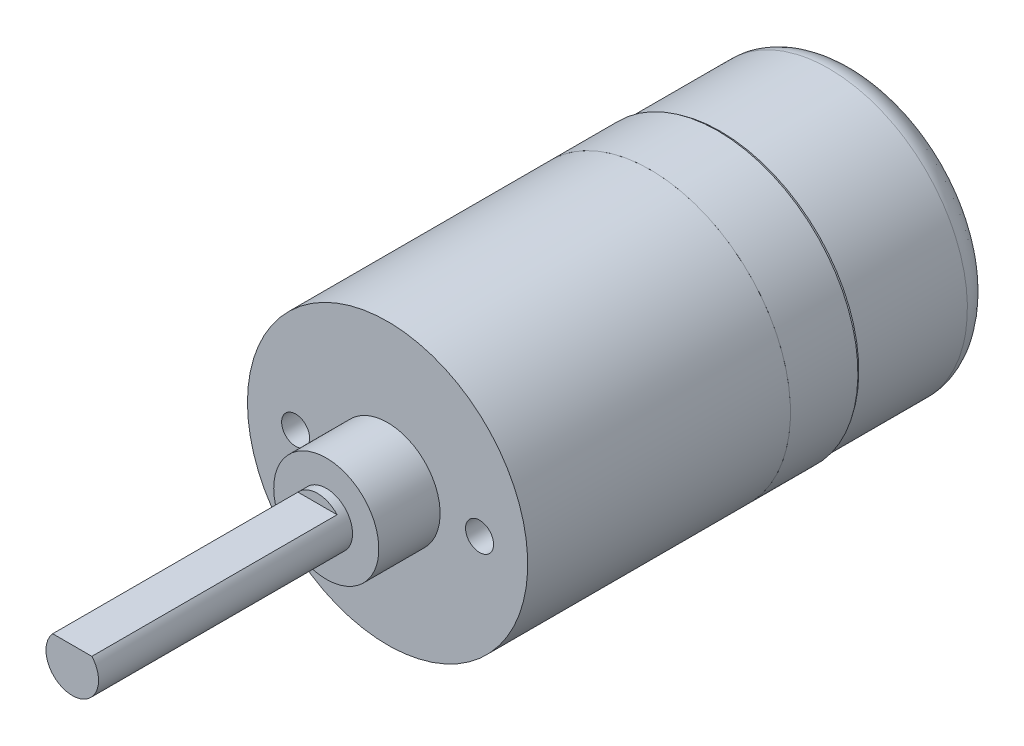
ISO-10303-21;
HEADER;
FILE_DESCRIPTION(('STEP AP214'),'2;1');
FILE_NAME('part.step','',(''),(''),'','','');
FILE_SCHEMA(('AUTOMOTIVE_DESIGN { 1 0 10303 214 1 1 1 1 }'));
ENDSEC;
DATA;
#1=APPLICATION_CONTEXT('core data for automotive mechanical design processes');
#2=APPLICATION_PROTOCOL_DEFINITION('international standard','automotive_design',2000,#1);
#3=PRODUCT_CONTEXT('',#1,'mechanical');
#4=PRODUCT('Part','Part','',(#3));
#5=PRODUCT_RELATED_PRODUCT_CATEGORY('part','',(#4));
#6=PRODUCT_DEFINITION_FORMATION('','',#4);
#7=PRODUCT_DEFINITION_CONTEXT('part definition',#1,'design');
#8=PRODUCT_DEFINITION('design','',#6,#7);
#9=PRODUCT_DEFINITION_SHAPE('','',#8);
#10=(LENGTH_UNIT() NAMED_UNIT(*) SI_UNIT(.MILLI.,.METRE.));
#11=(NAMED_UNIT(*) PLANE_ANGLE_UNIT() SI_UNIT($,.RADIAN.));
#12=(NAMED_UNIT(*) SI_UNIT($,.STERADIAN.) SOLID_ANGLE_UNIT());
#13=UNCERTAINTY_MEASURE_WITH_UNIT(LENGTH_MEASURE(1.E-05),#10,'distance_accuracy_value','');
#14=(GEOMETRIC_REPRESENTATION_CONTEXT(3) GLOBAL_UNCERTAINTY_ASSIGNED_CONTEXT((#13)) GLOBAL_UNIT_ASSIGNED_CONTEXT((#10,
#11,#12)) REPRESENTATION_CONTEXT('',''));
#15=CARTESIAN_POINT('',(0.,0.,0.));
#16=DIRECTION('',(0.,0.,1.));
#17=DIRECTION('',(1.,0.,0.));
#18=AXIS2_PLACEMENT_3D('',#15,#16,#17);
#19=CARTESIAN_POINT('',(0.,0.,33.));
#20=DIRECTION('',(0.,0.,1.));
#21=DIRECTION('',(1.,0.,0.));
#22=AXIS2_PLACEMENT_3D('',#19,#20,#21);
#23=PLANE('',#22);
#24=CARTESIAN_POINT('',(0.,0.,33.));
#25=DIRECTION('',(0.,0.,1.));
#26=DIRECTION('',(1.,0.,0.));
#27=AXIS2_PLACEMENT_3D('',#24,#25,#26);
#28=CIRCLE('',#27,1.5);
#29=CARTESIAN_POINT('',(1.11803398874988,1.00000000000001,33.));
#30=VERTEX_POINT('',#29);
#31=CARTESIAN_POINT('',(-1.11803398874988,1.00000000000001,33.));
#32=VERTEX_POINT('',#31);
#33=EDGE_CURVE('P0_E69',#30,#32,#28,.F.);
#34=ORIENTED_EDGE('',*,*,#33,.F.);
#35=DIRECTION('',(-1.,0.,0.));
#36=VECTOR('',#35,1.);
#37=CARTESIAN_POINT('',(-1.11803398874988,1.00000000000001,33.));
#38=LINE('',#37,#36);
#39=EDGE_CURVE('P0_E76',#30,#32,#38,.T.);
#40=ORIENTED_EDGE('',*,*,#39,.T.);
#41=EDGE_LOOP('',(#34,#40));
#42=FACE_BOUND('',#41,.T.);
#43=ADVANCED_FACE('P0_F38',(#42),#23,.T.);
#44=CARTESIAN_POINT('',(-5.25,0.,12.4999999999318));
#45=DIRECTION('',(0.,0.,1.));
#46=DIRECTION('',(0.,-1.,0.));
#47=AXIS2_PLACEMENT_3D('',#44,#45,#46);
#48=CONICAL_SURFACE('',#47,0.79999999992333,1.02974425862737);
#49=CARTESIAN_POINT('',(-5.25000000004638,0.,12.01931150473));
#50=VERTEX_POINT('',#49);
#51=VERTEX_LOOP('',#50);
#52=FACE_BOUND('',#51,.T.);
#53=CARTESIAN_POINT('',(-5.25,0.,12.5));
#54=DIRECTION('',(0.,0.,1.));
#55=DIRECTION('',(1.,0.,0.));
#56=AXIS2_PLACEMENT_3D('',#53,#54,#55);
#57=CIRCLE('',#56,0.799999999999999);
#58=CARTESIAN_POINT('',(-4.45,0.,12.5));
#59=VERTEX_POINT('',#58);
#60=EDGE_CURVE('P0_E95',#59,#59,#57,.T.);
#61=ORIENTED_EDGE('',*,*,#60,.T.);
#62=EDGE_LOOP('',(#61));
#63=FACE_BOUND('',#62,.T.);
#64=ADVANCED_FACE('P0_F150',(#52,#63),#48,.F.);
#65=CARTESIAN_POINT('',(5.25,0.,12.4999999999886));
#66=DIRECTION('',(0.,0.,1.));
#67=DIRECTION('',(1.,0.,0.));
#68=AXIS2_PLACEMENT_3D('',#65,#66,#67);
#69=CONICAL_SURFACE('',#68,0.800000000072941,1.02974425870993);
#70=CARTESIAN_POINT('',(5.25000000004638,0.,12.0193115047869));
#71=VERTEX_POINT('',#70);
#72=VERTEX_LOOP('',#71);
#73=FACE_BOUND('',#72,.T.);
#74=CARTESIAN_POINT('',(5.25,0.,12.5));
#75=DIRECTION('',(0.,0.,1.));
#76=DIRECTION('',(1.,0.,0.));
#77=AXIS2_PLACEMENT_3D('',#74,#75,#76);
#78=CIRCLE('',#77,0.799999999999999);
#79=CARTESIAN_POINT('',(6.05,0.,12.5));
#80=VERTEX_POINT('',#79);
#81=EDGE_CURVE('P0_E101',#80,#80,#78,.T.);
#82=ORIENTED_EDGE('',*,*,#81,.T.);
#83=EDGE_LOOP('',(#82));
#84=FACE_BOUND('',#83,.T.);
#85=ADVANCED_FACE('P0_F130',(#73,#84),#69,.F.);
#86=CARTESIAN_POINT('',(0.,8.,0.));
#87=DIRECTION('',(0.,0.,-1.));
#88=DIRECTION('',(-1.,0.,0.));
#89=AXIS2_PLACEMENT_3D('',#86,#87,#88);
#90=PLANE('',#89);
#91=CARTESIAN_POINT('',(0.,0.,0.));
#92=DIRECTION('',(0.,0.,-1.));
#93=DIRECTION('',(-1.,0.,0.));
#94=AXIS2_PLACEMENT_3D('',#91,#92,#93);
#95=CIRCLE('',#94,8.);
#96=CARTESIAN_POINT('',(-8.,0.,0.));
#97=VERTEX_POINT('',#96);
#98=EDGE_CURVE('P0_E75',#97,#97,#95,.F.);
#99=ORIENTED_EDGE('',*,*,#98,.F.);
#100=EDGE_LOOP('',(#99));
#101=FACE_BOUND('',#100,.T.);
#102=ADVANCED_FACE('P0_F145',(#101),#90,.T.);
#103=CARTESIAN_POINT('',(-5.25,0.,15.));
#104=DIRECTION('',(0.,0.,1.));
#105=DIRECTION('',(1.,0.,0.));
#106=AXIS2_PLACEMENT_3D('',#103,#104,#105);
#107=CYLINDRICAL_SURFACE('',#106,0.799999999999999);
#108=CARTESIAN_POINT('',(-5.25,0.,15.));
#109=DIRECTION('',(0.,0.,1.));
#110=DIRECTION('',(1.,0.,0.));
#111=AXIS2_PLACEMENT_3D('',#108,#109,#110);
#112=CIRCLE('',#111,0.799999999999999);
#113=CARTESIAN_POINT('',(-4.45,0.,15.));
#114=VERTEX_POINT('',#113);
#115=EDGE_CURVE('P0_E98',#114,#114,#112,.F.);
#116=ORIENTED_EDGE('',*,*,#115,.F.);
#117=EDGE_LOOP('',(#116));
#118=FACE_BOUND('',#117,.T.);
#119=ORIENTED_EDGE('',*,*,#60,.F.);
#120=EDGE_LOOP('',(#119));
#121=FACE_BOUND('',#120,.T.);
#122=ADVANCED_FACE('P0_F135',(#118,#121),#107,.F.);
#123=CARTESIAN_POINT('',(5.25,0.,15.));
#124=DIRECTION('',(0.,0.,1.));
#125=DIRECTION('',(1.,0.,0.));
#126=AXIS2_PLACEMENT_3D('',#123,#124,#125);
#127=CYLINDRICAL_SURFACE('',#126,0.799999999999999);
#128=CARTESIAN_POINT('',(5.25,0.,15.));
#129=DIRECTION('',(0.,0.,1.));
#130=DIRECTION('',(1.,0.,0.));
#131=AXIS2_PLACEMENT_3D('',#128,#129,#130);
#132=CIRCLE('',#131,0.799999999999999);
#133=CARTESIAN_POINT('',(6.05,0.,15.));
#134=VERTEX_POINT('',#133);
#135=EDGE_CURVE('P0_E102',#134,#134,#132,.F.);
#136=ORIENTED_EDGE('',*,*,#135,.F.);
#137=EDGE_LOOP('',(#136));
#138=FACE_BOUND('',#137,.T.);
#139=ORIENTED_EDGE('',*,*,#81,.F.);
#140=EDGE_LOOP('',(#139));
#141=FACE_BOUND('',#140,.T.);
#142=ADVANCED_FACE('P0_F132',(#138,#141),#127,.F.);
#143=CARTESIAN_POINT('',(0.,0.,0.));
#144=DIRECTION('',(0.,0.,-1.));
#145=DIRECTION('',(-1.,0.,0.));
#146=AXIS2_PLACEMENT_3D('',#143,#144,#145);
#147=CYLINDRICAL_SURFACE('',#146,8.);
#148=ORIENTED_EDGE('',*,*,#98,.T.);
#149=EDGE_LOOP('',(#148));
#150=FACE_BOUND('',#149,.T.);
#151=CARTESIAN_POINT('',(0.,0.,15.));
#152=DIRECTION('',(0.,0.,-1.));
#153=DIRECTION('',(-1.,0.,0.));
#154=AXIS2_PLACEMENT_3D('',#151,#152,#153);
#155=CIRCLE('',#154,8.);
#156=CARTESIAN_POINT('',(-8.,0.,15.));
#157=VERTEX_POINT('',#156);
#158=EDGE_CURVE('P0_E112',#157,#157,#155,.T.);
#159=ORIENTED_EDGE('',*,*,#158,.T.);
#160=EDGE_LOOP('',(#159));
#161=FACE_BOUND('',#160,.T.);
#162=ADVANCED_FACE('P0_F134',(#150,#161),#147,.T.);
#163=CARTESIAN_POINT('',(0.,3.,15.));
#164=DIRECTION('',(0.,0.,1.));
#165=DIRECTION('',(1.,0.,0.));
#166=AXIS2_PLACEMENT_3D('',#163,#164,#165);
#167=PLANE('',#166);
#168=ORIENTED_EDGE('',*,*,#158,.F.);
#169=EDGE_LOOP('',(#168));
#170=FACE_BOUND('',#169,.T.);
#171=CARTESIAN_POINT('',(0.,0.,15.));
#172=DIRECTION('',(0.,0.,-1.));
#173=DIRECTION('',(-1.,0.,0.));
#174=AXIS2_PLACEMENT_3D('',#171,#172,#173);
#175=CIRCLE('',#174,3.);
#176=CARTESIAN_POINT('',(-3.,0.,15.));
#177=VERTEX_POINT('',#176);
#178=EDGE_CURVE('P0_E107',#177,#177,#175,.T.);
#179=ORIENTED_EDGE('',*,*,#178,.T.);
#180=EDGE_LOOP('',(#179));
#181=FACE_BOUND('',#180,.T.);
#182=ORIENTED_EDGE('',*,*,#135,.T.);
#183=EDGE_LOOP('',(#182));
#184=FACE_BOUND('',#183,.T.);
#185=ORIENTED_EDGE('',*,*,#115,.T.);
#186=EDGE_LOOP('',(#185));
#187=FACE_BOUND('',#186,.T.);
#188=ADVANCED_FACE('P0_F142',(#170,#181,#184,#187),#167,.T.);
#189=CARTESIAN_POINT('',(0.,0.,0.));
#190=DIRECTION('',(0.,0.,-1.));
#191=DIRECTION('',(-1.,0.,0.));
#192=AXIS2_PLACEMENT_3D('',#189,#190,#191);
#193=CYLINDRICAL_SURFACE('',#192,3.);
#194=ORIENTED_EDGE('',*,*,#178,.F.);
#195=EDGE_LOOP('',(#194));
#196=FACE_BOUND('',#195,.T.);
#197=CARTESIAN_POINT('',(0.,0.,18.5));
#198=DIRECTION('',(0.,0.,-1.));
#199=DIRECTION('',(-1.,0.,0.));
#200=AXIS2_PLACEMENT_3D('',#197,#198,#199);
#201=CIRCLE('',#200,3.);
#202=CARTESIAN_POINT('',(-3.,0.,18.5));
#203=VERTEX_POINT('',#202);
#204=EDGE_CURVE('P0_E90',#203,#203,#201,.T.);
#205=ORIENTED_EDGE('',*,*,#204,.T.);
#206=EDGE_LOOP('',(#205));
#207=FACE_BOUND('',#206,.T.);
#208=ADVANCED_FACE('P0_F167',(#196,#207),#193,.T.);
#209=CARTESIAN_POINT('',(0.,0.,19.));
#210=DIRECTION('',(0.,0.,1.));
#211=DIRECTION('',(1.,0.,0.));
#212=AXIS2_PLACEMENT_3D('',#209,#210,#211);
#213=PLANE('',#212);
#214=CARTESIAN_POINT('',(0.,0.,19.));
#215=DIRECTION('',(0.,0.,-1.));
#216=DIRECTION('',(-1.,0.,0.));
#217=AXIS2_PLACEMENT_3D('',#214,#215,#216);
#218=CIRCLE('',#217,1.5);
#219=CARTESIAN_POINT('',(-1.11803398874988,1.00000000000001,19.));
#220=VERTEX_POINT('',#219);
#221=CARTESIAN_POINT('',(1.11803398874988,1.00000000000001,19.));
#222=VERTEX_POINT('',#221);
#223=EDGE_CURVE('P0_E82',#220,#222,#218,.T.);
#224=ORIENTED_EDGE('',*,*,#223,.F.);
#225=DIRECTION('',(1.,0.,0.));
#226=VECTOR('',#225,1.);
#227=CARTESIAN_POINT('',(-1.11803398874988,1.00000000000001,19.));
#228=LINE('',#227,#226);
#229=EDGE_CURVE('P0_E11',#220,#222,#228,.T.);
#230=ORIENTED_EDGE('',*,*,#229,.T.);
#231=EDGE_LOOP('',(#224,#230));
#232=FACE_BOUND('',#231,.T.);
#233=ADVANCED_FACE('P0_F165',(#232),#213,.T.);
#234=CARTESIAN_POINT('',(-1.11803398874988,1.00000000000001,19.));
#235=DIRECTION('',(0.,-1.,0.));
#236=DIRECTION('',(0.,0.,-1.));
#237=AXIS2_PLACEMENT_3D('',#234,#235,#236);
#238=PLANE('',#237);
#239=ORIENTED_EDGE('',*,*,#39,.F.);
#240=DIRECTION('',(0.,0.,-1.));
#241=VECTOR('',#240,1.);
#242=CARTESIAN_POINT('',(1.11803398874988,1.00000000000001,0.));
#243=LINE('',#242,#241);
#244=EDGE_CURVE('P0_E74',#222,#30,#243,.F.);
#245=ORIENTED_EDGE('',*,*,#244,.F.);
#246=ORIENTED_EDGE('',*,*,#229,.F.);
#247=DIRECTION('',(0.,0.,-1.));
#248=VECTOR('',#247,1.);
#249=CARTESIAN_POINT('',(-1.11803398874988,1.00000000000001,0.));
#250=LINE('',#249,#248);
#251=EDGE_CURVE('P0_E42',#32,#220,#250,.T.);
#252=ORIENTED_EDGE('',*,*,#251,.F.);
#253=EDGE_LOOP('',(#239,#245,#246,#252));
#254=FACE_BOUND('',#253,.T.);
#255=ADVANCED_FACE('P0_F80',(#254),#238,.F.);
#256=CARTESIAN_POINT('',(0.,1.5,18.5));
#257=DIRECTION('',(0.,0.,1.));
#258=DIRECTION('',(1.,0.,0.));
#259=AXIS2_PLACEMENT_3D('',#256,#257,#258);
#260=PLANE('',#259);
#261=ORIENTED_EDGE('',*,*,#204,.F.);
#262=EDGE_LOOP('',(#261));
#263=FACE_BOUND('',#262,.T.);
#264=CARTESIAN_POINT('',(0.,0.,18.5));
#265=DIRECTION('',(0.,0.,-1.));
#266=DIRECTION('',(-1.,0.,0.));
#267=AXIS2_PLACEMENT_3D('',#264,#265,#266);
#268=CIRCLE('',#267,1.5);
#269=CARTESIAN_POINT('',(-1.5,0.,18.5));
#270=VERTEX_POINT('',#269);
#271=EDGE_CURVE('P0_E84',#270,#270,#268,.T.);
#272=ORIENTED_EDGE('',*,*,#271,.T.);
#273=EDGE_LOOP('',(#272));
#274=FACE_BOUND('',#273,.T.);
#275=ADVANCED_FACE('P0_F161',(#263,#274),#260,.T.);
#276=CARTESIAN_POINT('',(0.,0.,0.));
#277=DIRECTION('',(0.,0.,-1.));
#278=DIRECTION('',(-1.,0.,0.));
#279=AXIS2_PLACEMENT_3D('',#276,#277,#278);
#280=CYLINDRICAL_SURFACE('',#279,1.5);
#281=ORIENTED_EDGE('',*,*,#271,.F.);
#282=EDGE_LOOP('',(#281));
#283=FACE_BOUND('',#282,.T.);
#284=ORIENTED_EDGE('',*,*,#244,.T.);
#285=ORIENTED_EDGE('',*,*,#33,.T.);
#286=ORIENTED_EDGE('',*,*,#251,.T.);
#287=ORIENTED_EDGE('',*,*,#223,.T.);
#288=EDGE_LOOP('',(#284,#285,#286,#287));
#289=FACE_BOUND('',#288,.T.);
#290=ADVANCED_FACE('P0_F40',(#283,#289),#280,.T.);
#291=CLOSED_SHELL('',(#43,#64,#85,#102,#122,#142,#162,#188,#208,#233,#255,#275,#290));
#292=MANIFOLD_SOLID_BREP('P0_B2',#291);
#293=CARTESIAN_POINT('',(0.,0.,0.));
#294=DIRECTION('',(0.,0.,1.));
#295=DIRECTION('',(0.,-1.,0.));
#296=AXIS2_PLACEMENT_3D('',#293,#294,#295);
#297=PLANE('',#296);
#298=CARTESIAN_POINT('',(0.,0.,0.));
#299=DIRECTION('',(0.,0.,-1.));
#300=DIRECTION('',(0.,1.,0.));
#301=AXIS2_PLACEMENT_3D('',#298,#299,#300);
#302=CIRCLE('',#301,8.);
#303=CARTESIAN_POINT('',(0.,8.,0.));
#304=VERTEX_POINT('',#303);
#305=EDGE_CURVE('P1_E35',#304,#304,#302,.T.);
#306=ORIENTED_EDGE('',*,*,#305,.F.);
#307=EDGE_LOOP('',(#306));
#308=FACE_BOUND('',#307,.T.);
#309=ADVANCED_FACE('P1_F14',(#308),#297,.T.);
#310=CARTESIAN_POINT('',(0.,0.,0.));
#311=DIRECTION('',(0.,0.,-1.));
#312=DIRECTION('',(0.,1.,0.));
#313=AXIS2_PLACEMENT_3D('',#310,#311,#312);
#314=CYLINDRICAL_SURFACE('',#313,8.);
#315=CARTESIAN_POINT('',(0.,0.,-3.85));
#316=DIRECTION('',(0.,0.,-1.));
#317=DIRECTION('',(0.,1.,0.));
#318=AXIS2_PLACEMENT_3D('',#315,#316,#317);
#319=CIRCLE('',#318,8.);
#320=CARTESIAN_POINT('',(0.,8.,-3.85));
#321=VERTEX_POINT('',#320);
#322=EDGE_CURVE('P1_E26',#321,#321,#319,.T.);
#323=ORIENTED_EDGE('',*,*,#322,.F.);
#324=EDGE_LOOP('',(#323));
#325=FACE_BOUND('',#324,.T.);
#326=ORIENTED_EDGE('',*,*,#305,.T.);
#327=EDGE_LOOP('',(#326));
#328=FACE_BOUND('',#327,.T.);
#329=ADVANCED_FACE('P1_F40',(#325,#328),#314,.T.);
#330=CARTESIAN_POINT('',(0.,8.,-3.85));
#331=DIRECTION('',(0.,0.,-1.));
#332=DIRECTION('',(0.,1.,0.));
#333=AXIS2_PLACEMENT_3D('',#330,#331,#332);
#334=PLANE('',#333);
#335=CARTESIAN_POINT('',(0.,0.,-3.85));
#336=DIRECTION('',(0.,0.,-1.));
#337=DIRECTION('',(0.,1.,0.));
#338=AXIS2_PLACEMENT_3D('',#335,#336,#337);
#339=CIRCLE('',#338,6.);
#340=CARTESIAN_POINT('',(0.,6.,-3.85));
#341=VERTEX_POINT('',#340);
#342=EDGE_CURVE('P1_E21',#341,#341,#339,.T.);
#343=ORIENTED_EDGE('',*,*,#342,.F.);
#344=EDGE_LOOP('',(#343));
#345=FACE_BOUND('',#344,.T.);
#346=ORIENTED_EDGE('',*,*,#322,.T.);
#347=EDGE_LOOP('',(#346));
#348=FACE_BOUND('',#347,.T.);
#349=ADVANCED_FACE('P1_F47',(#345,#348),#334,.T.);
#350=CARTESIAN_POINT('',(0.,6.,-9.85));
#351=DIRECTION('',(0.,0.,-1.));
#352=DIRECTION('',(0.,1.,0.));
#353=AXIS2_PLACEMENT_3D('',#350,#351,#352);
#354=PLANE('',#353);
#355=CARTESIAN_POINT('',(0.,0.,-9.85));
#356=DIRECTION('',(0.,0.,-1.));
#357=DIRECTION('',(0.,1.,0.));
#358=AXIS2_PLACEMENT_3D('',#355,#356,#357);
#359=CIRCLE('',#358,6.);
#360=CARTESIAN_POINT('',(0.,6.,-9.85));
#361=VERTEX_POINT('',#360);
#362=EDGE_CURVE('P1_E10',#361,#361,#359,.F.);
#363=ORIENTED_EDGE('',*,*,#362,.F.);
#364=EDGE_LOOP('',(#363));
#365=FACE_BOUND('',#364,.T.);
#366=ADVANCED_FACE('P1_F51',(#365),#354,.T.);
#367=CARTESIAN_POINT('',(0.,0.,0.));
#368=DIRECTION('',(0.,0.,-1.));
#369=DIRECTION('',(0.,1.,0.));
#370=AXIS2_PLACEMENT_3D('',#367,#368,#369);
#371=CYLINDRICAL_SURFACE('',#370,6.);
#372=ORIENTED_EDGE('',*,*,#362,.T.);
#373=EDGE_LOOP('',(#372));
#374=FACE_BOUND('',#373,.T.);
#375=ORIENTED_EDGE('',*,*,#342,.T.);
#376=EDGE_LOOP('',(#375));
#377=FACE_BOUND('',#376,.T.);
#378=ADVANCED_FACE('P1_F49',(#374,#377),#371,.T.);
#379=CLOSED_SHELL('',(#309,#329,#349,#366,#378));
#380=MANIFOLD_SOLID_BREP('P1_B1',#379);
#381=CARTESIAN_POINT('',(0.,6.25,-10.1));
#382=DIRECTION('',(0.,0.,1.));
#383=DIRECTION('',(0.,-1.,0.));
#384=AXIS2_PLACEMENT_3D('',#381,#382,#383);
#385=PLANE('',#384);
#386=CARTESIAN_POINT('',(0.,0.,-10.1));
#387=DIRECTION('',(0.,0.,-1.));
#388=DIRECTION('',(0.,1.,0.));
#389=AXIS2_PLACEMENT_3D('',#386,#387,#388);
#390=CIRCLE('',#389,6.25);
#391=CARTESIAN_POINT('',(0.,6.25,-10.1));
#392=VERTEX_POINT('',#391);
#393=EDGE_CURVE('P2_E39',#392,#392,#390,.F.);
#394=ORIENTED_EDGE('',*,*,#393,.T.);
#395=EDGE_LOOP('',(#394));
#396=FACE_BOUND('',#395,.T.);
#397=ADVANCED_FACE('P2_F14',(#396),#385,.T.);
#398=CARTESIAN_POINT('',(0.,0.,-12.2));
#399=DIRECTION('',(0.,0.,-1.));
#400=DIRECTION('',(0.,1.,0.));
#401=AXIS2_PLACEMENT_3D('',#398,#399,#400);
#402=PLANE('',#401);
#403=CARTESIAN_POINT('',(0.,4.9,-12.2));
#404=CARTESIAN_POINT('',(-0.641408495655412,4.9,-12.2));
#405=CARTESIAN_POINT('',(-1.28256463747389,4.77246611397083,-12.2));
#406=CARTESIAN_POINT('',(-2.46773299970401,4.28155330463978,-12.2));
#407=CARTESIAN_POINT('',(-3.01127893102537,3.9183675246028,-12.2));
#408=CARTESIAN_POINT('',(-3.91836752460281,3.01127893102535,-12.2));
#409=CARTESIAN_POINT('',(-4.2815533046395,2.46773299970399,-12.2));
#410=CARTESIAN_POINT('',(-4.77246611397111,1.28256463747387,-12.2));
#411=CARTESIAN_POINT('',(-4.9,0.641408495655556,-12.2));
#412=CARTESIAN_POINT('',(-4.9,-0.641408495655537,-12.2));
#413=CARTESIAN_POINT('',(-4.77246611397083,-1.28256463747395,-12.2));
#414=CARTESIAN_POINT('',(-4.28155330463978,-2.46773299970394,-12.2));
#415=CARTESIAN_POINT('',(-3.91836752460279,-3.01127893102551,-12.2));
#416=CARTESIAN_POINT('',(-3.01127893102538,-3.91836752460265,-12.2));
#417=CARTESIAN_POINT('',(-2.46773299970396,-4.28155330463948,-12.2));
#418=CARTESIAN_POINT('',(-1.28256463747391,-4.77246611397114,-12.2));
#419=CARTESIAN_POINT('',(-0.641408495655545,-4.9,-12.2));
#420=CARTESIAN_POINT('',(0.641408495655546,-4.9,-12.2));
#421=CARTESIAN_POINT('',(1.28256463747399,-4.77246611397085,-12.2));
#422=CARTESIAN_POINT('',(2.4677329997039,-4.28155330463975,-12.2));
#423=CARTESIAN_POINT('',(3.01127893102537,-3.91836752460265,-12.2));
#424=CARTESIAN_POINT('',(3.91836752460279,-3.01127893102551,-12.2));
#425=CARTESIAN_POINT('',(4.28155330463977,-2.46773299970391,-12.2));
#426=CARTESIAN_POINT('',(4.77246611397084,-1.28256463747397,-12.2));
#427=CARTESIAN_POINT('',(4.9,-0.641408495655544,-12.2));
#428=CARTESIAN_POINT('',(4.9,0.641408495655547,-12.2));
#429=CARTESIAN_POINT('',(4.77246611397084,1.28256463747397,-12.2));
#430=CARTESIAN_POINT('',(4.28155330463977,2.46773299970391,-12.2));
#431=CARTESIAN_POINT('',(3.91836752460262,3.01127893102527,-12.2));
#432=CARTESIAN_POINT('',(3.01127893102555,3.9183675246029,-12.2));
#433=CARTESIAN_POINT('',(2.46773299970387,4.2815533046399,-12.2));
#434=CARTESIAN_POINT('',(1.28256463747401,4.77246611397071,-12.2));
#435=CARTESIAN_POINT('',(0.641408495655411,4.9,-12.2));
#436=CARTESIAN_POINT('',(0.,4.9,-12.2));
#437=(BOUNDED_CURVE() B_SPLINE_CURVE(3,(#403,#404,#405,#406,#407,#408,#409,#410,#411,#412,#413,
#414,#415,#416,#417,#418,#419,#420,#421,#422,#423,#424,#425,#426,#427,#428,#429,#430,#431,#432,
#433,#434,#435,#436),.UNSPECIFIED.,.T.,.F.) B_SPLINE_CURVE_WITH_KNOTS((4,2,2,2,2,2,2,2,2,2,2,2,
2,2,2,2,4),(0.,0.392699081698725,0.785398163397448,1.17809724509617,1.5707963267949,
1.96349540849362,2.35619449019234,2.74889357189107,3.14159265358979,3.53429173528852,
3.92699081698724,4.31968989868597,4.71238898038469,5.10508806208341,5.49778714378214,
5.89048622548086,6.28318530717959),
.UNSPECIFIED.) CURVE() GEOMETRIC_REPRESENTATION_ITEM() RATIONAL_B_SPLINE_CURVE((1.,1.,1.,1.,1.,
1.,1.,1.,1.,1.,1.,1.,1.,1.,1.,1.,1.,1.,1.,1.,1.,1.,1.,1.,1.,1.,1.,1.,1.,1.,1.,1.,1.,1.)) REPRESENTATION_ITEM(''));
#438=CARTESIAN_POINT('',(0.,4.9,-12.2));
#439=VERTEX_POINT('',#438);
#440=EDGE_CURVE('P2_E37',#439,#439,#437,.T.);
#441=ORIENTED_EDGE('',*,*,#440,.F.);
#442=EDGE_LOOP('',(#441));
#443=FACE_BOUND('',#442,.T.);
#444=ADVANCED_FACE('P2_F54',(#443),#402,.T.);
#445=CARTESIAN_POINT('',(0.,0.,0.));
#446=DIRECTION('',(0.,0.,-1.));
#447=DIRECTION('',(0.,1.,0.));
#448=AXIS2_PLACEMENT_3D('',#445,#446,#447);
#449=CYLINDRICAL_SURFACE('',#448,6.25);
#450=CARTESIAN_POINT('',(0.,0.,-4.));
#451=DIRECTION('',(0.,0.,-1.));
#452=DIRECTION('',(0.,1.,0.));
#453=AXIS2_PLACEMENT_3D('',#450,#451,#452);
#454=CIRCLE('',#453,6.25);
#455=CARTESIAN_POINT('',(0.,6.25,-4.));
#456=VERTEX_POINT('',#455);
#457=EDGE_CURVE('P2_E26',#456,#456,#454,.T.);
#458=ORIENTED_EDGE('',*,*,#457,.F.);
#459=EDGE_LOOP('',(#458));
#460=FACE_BOUND('',#459,.T.);
#461=ORIENTED_EDGE('',*,*,#393,.F.);
#462=EDGE_LOOP('',(#461));
#463=FACE_BOUND('',#462,.T.);
#464=ADVANCED_FACE('P2_F63',(#460,#463),#449,.F.);
#465=CARTESIAN_POINT('',(0.,4.9,-12.2));
#466=CARTESIAN_POINT('',(0.641408495655411,4.9,-12.2));
#467=CARTESIAN_POINT('',(1.28256463747401,4.77246611397071,-12.2));
#468=CARTESIAN_POINT('',(2.46773299970387,4.2815533046399,-12.2));
#469=CARTESIAN_POINT('',(3.01127893102555,3.9183675246029,-12.2));
#470=CARTESIAN_POINT('',(3.91836752460262,3.01127893102527,-12.2));
#471=CARTESIAN_POINT('',(4.28155330463977,2.46773299970391,-12.2));
#472=CARTESIAN_POINT('',(4.77246611397084,1.28256463747397,-12.2));
#473=CARTESIAN_POINT('',(4.9,0.641408495655547,-12.2));
#474=CARTESIAN_POINT('',(4.9,-0.641408495655544,-12.2));
#475=CARTESIAN_POINT('',(4.77246611397084,-1.28256463747397,-12.2));
#476=CARTESIAN_POINT('',(4.28155330463977,-2.46773299970391,-12.2));
#477=CARTESIAN_POINT('',(3.91836752460279,-3.01127893102551,-12.2));
#478=CARTESIAN_POINT('',(3.01127893102537,-3.91836752460265,-12.2));
#479=CARTESIAN_POINT('',(2.4677329997039,-4.28155330463975,-12.2));
#480=CARTESIAN_POINT('',(1.28256463747399,-4.77246611397085,-12.2));
#481=CARTESIAN_POINT('',(0.641408495655546,-4.9,-12.2));
#482=CARTESIAN_POINT('',(-0.641408495655545,-4.9,-12.2));
#483=CARTESIAN_POINT('',(-1.28256463747391,-4.77246611397114,-12.2));
#484=CARTESIAN_POINT('',(-2.46773299970396,-4.28155330463948,-12.2));
#485=CARTESIAN_POINT('',(-3.01127893102538,-3.91836752460265,-12.2));
#486=CARTESIAN_POINT('',(-3.91836752460279,-3.01127893102551,-12.2));
#487=CARTESIAN_POINT('',(-4.28155330463978,-2.46773299970394,-12.2));
#488=CARTESIAN_POINT('',(-4.77246611397083,-1.28256463747395,-12.2));
#489=CARTESIAN_POINT('',(-4.9,-0.641408495655537,-12.2));
#490=CARTESIAN_POINT('',(-4.9,0.641408495655556,-12.2));
#491=CARTESIAN_POINT('',(-4.77246611397111,1.28256463747387,-12.2));
#492=CARTESIAN_POINT('',(-4.2815533046395,2.46773299970399,-12.2));
#493=CARTESIAN_POINT('',(-3.91836752460281,3.01127893102535,-12.2));
#494=CARTESIAN_POINT('',(-3.01127893102537,3.9183675246028,-12.2));
#495=CARTESIAN_POINT('',(-2.46773299970401,4.28155330463978,-12.2));
#496=CARTESIAN_POINT('',(-1.28256463747389,4.77246611397083,-12.2));
#497=CARTESIAN_POINT('',(-0.641408495655412,4.9,-12.2));
#498=CARTESIAN_POINT('',(0.,4.9,-12.2));
#499=CARTESIAN_POINT('',(0.,7.9,-12.2));
#500=CARTESIAN_POINT('',(1.03410757462811,7.89999999999944,-12.2));
#501=CARTESIAN_POINT('',(2.06780829307035,7.69438414293231,-12.2));
#502=CARTESIAN_POINT('',(3.97858993829807,6.90291247074602,-12.2));
#503=CARTESIAN_POINT('',(4.85491909287789,6.31736804986957,-12.2));
#504=CARTESIAN_POINT('',(6.31736804986957,4.85491909287789,-12.2));
#505=CARTESIAN_POINT('',(6.90291247074581,3.97858993829803,-12.2));
#506=CARTESIAN_POINT('',(7.69438414293253,2.06780829307039,-12.2));
#507=CARTESIAN_POINT('',(7.9,1.03410757462833,-12.2));
#508=CARTESIAN_POINT('',(7.9,-1.03410757462833,-12.2));
#509=CARTESIAN_POINT('',(7.69438414293252,-2.06780829307025,-12.2));
#510=CARTESIAN_POINT('',(6.90291247074581,-3.97858993829817,-12.2));
#511=CARTESIAN_POINT('',(6.31736804986972,-4.85491909287773,-12.2000000000006));
#512=CARTESIAN_POINT('',(4.85491909287772,-6.31736804986973,-12.1999999999994));
#513=CARTESIAN_POINT('',(3.97858993829798,-6.90291247074568,-12.2));
#514=CARTESIAN_POINT('',(2.06780829307046,-7.69438414293264,-12.2));
#515=CARTESIAN_POINT('',(1.03410757462833,-7.9,-12.2));
#516=CARTESIAN_POINT('',(-1.03410757462833,-7.9,-12.2));
#517=CARTESIAN_POINT('',(-2.06780829307016,-7.69438414293265,-12.2));
#518=CARTESIAN_POINT('',(-3.97858993829823,-6.90291247074569,-12.2));
#519=CARTESIAN_POINT('',(-4.85491909287773,-6.31736804986972,-12.2));
#520=CARTESIAN_POINT('',(-6.31736804986973,-4.85491909287772,-12.2));
#521=CARTESIAN_POINT('',(-6.90291247074593,-3.97858993829838,-12.2));
#522=CARTESIAN_POINT('',(-7.69438414293239,-2.06780829307005,-12.2));
#523=CARTESIAN_POINT('',(-7.9,-1.03410757462832,-12.2));
#524=CARTESIAN_POINT('',(-7.9,1.03410757462834,-12.2));
#525=CARTESIAN_POINT('',(-7.69438414293296,2.06780829307017,-12.2));
#526=CARTESIAN_POINT('',(-6.90291247074538,3.97858993829823,-12.2));
#527=CARTESIAN_POINT('',(-6.31736804986994,4.85491909287723,-12.2));
#528=CARTESIAN_POINT('',(-4.85491909287754,6.31736804987019,-12.2));
#529=CARTESIAN_POINT('',(-3.97858993829839,6.90291247074565,-12.2));
#530=CARTESIAN_POINT('',(-2.06780829307005,7.69438414293267,-12.2));
#531=CARTESIAN_POINT('',(-1.03410757462811,7.90000000000056,-12.2));
#532=CARTESIAN_POINT('',(0.,7.9,-12.2));
#533=CARTESIAN_POINT('',(0.,7.9,-10.2));
#534=CARTESIAN_POINT('',(1.03410757462811,7.9,-10.2));
#535=CARTESIAN_POINT('',(2.06780829307046,7.69438414293257,-10.2));
#536=CARTESIAN_POINT('',(3.97858993829796,6.90291247074576,-10.2));
#537=CARTESIAN_POINT('',(4.85491909287789,6.31736804986957,-10.2));
#538=CARTESIAN_POINT('',(6.31736804986957,4.85491909287789,-10.2));
#539=CARTESIAN_POINT('',(6.90291247074575,3.978589938298,-10.2));
#540=CARTESIAN_POINT('',(7.69438414293259,2.06780829307041,-10.2));
#541=CARTESIAN_POINT('',(7.9,1.03410757462833,-10.2));
#542=CARTESIAN_POINT('',(7.9,-1.03410757462833,-10.2));
#543=CARTESIAN_POINT('',(7.69438414293264,-2.0678082930703,-10.2));
#544=CARTESIAN_POINT('',(6.90291247074569,-3.97858993829813,-10.2));
#545=CARTESIAN_POINT('',(6.31736804986972,-4.85491909287773,-10.2));
#546=CARTESIAN_POINT('',(4.85491909287772,-6.31736804986973,-10.2));
#547=CARTESIAN_POINT('',(3.978589938298,-6.90291247074574,-10.2));
#548=CARTESIAN_POINT('',(2.06780829307044,-7.69438414293258,-10.2));
#549=CARTESIAN_POINT('',(1.03410757462833,-7.9,-10.2));
#550=CARTESIAN_POINT('',(-1.03410757462833,-7.9,-10.2));
#551=CARTESIAN_POINT('',(-2.06780829307018,-7.69438414293268,-10.2));
#552=CARTESIAN_POINT('',(-3.97858993829822,-6.90291247074566,-10.2));
#553=CARTESIAN_POINT('',(-4.85491909287773,-6.31736804986972,-10.2));
#554=CARTESIAN_POINT('',(-6.31736804986973,-4.85491909287772,-10.2));
#555=CARTESIAN_POINT('',(-6.90291247074568,-3.97858993829814,-10.2));
#556=CARTESIAN_POINT('',(-7.69438414293264,-2.06780829307029,-10.2));
#557=CARTESIAN_POINT('',(-7.9,-1.03410757462832,-10.2));
#558=CARTESIAN_POINT('',(-7.9,1.03410757462834,-10.2));
#559=CARTESIAN_POINT('',(-7.69438414293273,2.06780829307007,-10.2));
#560=CARTESIAN_POINT('',(-6.90291247074561,3.97858993829832,-10.2));
#561=CARTESIAN_POINT('',(-6.31736804986994,4.85491909287751,-10.2));
#562=CARTESIAN_POINT('',(-4.85491909287754,6.31736804986991,-10.2));
#563=CARTESIAN_POINT('',(-3.97858993829836,6.9029124707456,-10.2));
#564=CARTESIAN_POINT('',(-2.06780829307008,7.69438414293273,-10.2));
#565=CARTESIAN_POINT('',(-1.03410757462811,7.9,-10.2));
#566=CARTESIAN_POINT('',(0.,7.9,-10.2));
#567=(BOUNDED_SURFACE() B_SPLINE_SURFACE(2,3,((#465,#466,#467,#468,#469,#470,#471,#472,#473,
#474,#475,#476,#477,#478,#479,#480,#481,#482,#483,#484,#485,#486,#487,#488,#489,#490,#491,#492,
#493,#494,#495,#496,#497,#498),(#499,#500,#501,#502,#503,#504,#505,#506,#507,#508,#509,#510,
#511,#512,#513,#514,#515,#516,#517,#518,#519,#520,#521,#522,#523,#524,#525,#526,#527,#528,#529,
#530,#531,#532),(#533,#534,#535,#536,#537,#538,#539,#540,#541,#542,#543,#544,#545,#546,#547,
#548,#549,#550,#551,#552,#553,#554,#555,#556,#557,#558,#559,#560,#561,#562,#563,#564,#565,
#566)),.UNSPECIFIED.,.F.,.T.,.F.) B_SPLINE_SURFACE_WITH_KNOTS((3,3),(4,2,2,2,2,2,2,2,2,2,2,2,2,
2,2,2,4),(0.,1.),(0.,0.392699081698724,0.785398163397448,1.17809724509617,1.5707963267949,
1.96349540849362,2.35619449019234,2.74889357189107,3.14159265358979,3.53429173528852,
3.92699081698724,4.31968989868597,4.71238898038469,5.10508806208341,5.49778714378214,
5.89048622548086,6.28318530717959),
.UNSPECIFIED.) GEOMETRIC_REPRESENTATION_ITEM() RATIONAL_B_SPLINE_SURFACE(((1.,1.,1.,1.,1.,1.,1.,
1.,1.,1.,1.,1.,1.,1.,1.,1.,1.,1.,1.,1.,1.,1.,1.,1.,1.,1.,1.,1.,1.,1.,1.,1.,1.,1.),
(0.707106781186548,0.707106781186548,0.707106781186548,0.707106781186548,0.707106781186548,
0.707106781186548,0.707106781186548,0.707106781186548,0.707106781186548,0.707106781186548,
0.707106781186548,0.707106781186548,0.707106781186548,0.707106781186548,0.707106781186548,
0.707106781186548,0.707106781186548,0.707106781186548,0.707106781186548,0.707106781186548,
0.707106781186547,0.707106781186547,0.707106781186548,0.707106781186548,0.707106781186548,
0.707106781186548,0.707106781186548,0.707106781186548,0.707106781186548,0.707106781186548,
0.707106781186548,0.707106781186548,0.707106781186548,0.707106781186548),(1.,1.,1.,1.,1.,1.,1.,
1.,1.,1.,1.,1.,1.,1.,1.,1.,1.,1.,1.,1.,1.,1.,1.,1.,1.,1.,1.,1.,1.,1.,1.,1.,1.,1.))) REPRESENTATION_ITEM('') SURFACE());
#568=CARTESIAN_POINT('',(0.,7.9,-10.2));
#569=CARTESIAN_POINT('',(1.03410757462811,7.9,-10.2));
#570=CARTESIAN_POINT('',(2.06780829307046,7.69438414293257,-10.2));
#571=CARTESIAN_POINT('',(3.97858993829796,6.90291247074576,-10.2));
#572=CARTESIAN_POINT('',(4.85491909287789,6.31736804986957,-10.2));
#573=CARTESIAN_POINT('',(6.31736804986957,4.85491909287789,-10.2));
#574=CARTESIAN_POINT('',(6.90291247074575,3.978589938298,-10.2));
#575=CARTESIAN_POINT('',(7.69438414293259,2.06780829307041,-10.2));
#576=CARTESIAN_POINT('',(7.9,1.03410757462833,-10.2));
#577=CARTESIAN_POINT('',(7.9,-1.03410757462833,-10.2));
#578=CARTESIAN_POINT('',(7.69438414293264,-2.0678082930703,-10.2));
#579=CARTESIAN_POINT('',(6.90291247074569,-3.97858993829813,-10.2));
#580=CARTESIAN_POINT('',(6.31736804986972,-4.85491909287773,-10.2));
#581=CARTESIAN_POINT('',(4.85491909287772,-6.31736804986973,-10.2));
#582=CARTESIAN_POINT('',(3.978589938298,-6.90291247074574,-10.2));
#583=CARTESIAN_POINT('',(2.06780829307044,-7.69438414293258,-10.2));
#584=CARTESIAN_POINT('',(1.03410757462833,-7.9,-10.2));
#585=CARTESIAN_POINT('',(-1.03410757462833,-7.9,-10.2));
#586=CARTESIAN_POINT('',(-2.06780829307018,-7.69438414293268,-10.2));
#587=CARTESIAN_POINT('',(-3.97858993829822,-6.90291247074566,-10.2));
#588=CARTESIAN_POINT('',(-4.85491909287773,-6.31736804986972,-10.2));
#589=CARTESIAN_POINT('',(-6.31736804986973,-4.85491909287772,-10.2));
#590=CARTESIAN_POINT('',(-6.90291247074568,-3.97858993829814,-10.2));
#591=CARTESIAN_POINT('',(-7.69438414293264,-2.06780829307029,-10.2));
#592=CARTESIAN_POINT('',(-7.9,-1.03410757462832,-10.2));
#593=CARTESIAN_POINT('',(-7.9,1.03410757462834,-10.2));
#594=CARTESIAN_POINT('',(-7.69438414293273,2.06780829307007,-10.2));
#595=CARTESIAN_POINT('',(-6.90291247074561,3.97858993829832,-10.2));
#596=CARTESIAN_POINT('',(-6.31736804986994,4.85491909287751,-10.2));
#597=CARTESIAN_POINT('',(-4.85491909287754,6.31736804986991,-10.2));
#598=CARTESIAN_POINT('',(-3.97858993829836,6.9029124707456,-10.2));
#599=CARTESIAN_POINT('',(-2.06780829307008,7.69438414293273,-10.2));
#600=CARTESIAN_POINT('',(-1.03410757462811,7.9,-10.2));
#601=CARTESIAN_POINT('',(0.,7.9,-10.2));
#602=(BOUNDED_CURVE() B_SPLINE_CURVE(3,(#568,#569,#570,#571,#572,#573,#574,#575,#576,#577,#578,
#579,#580,#581,#582,#583,#584,#585,#586,#587,#588,#589,#590,#591,#592,#593,#594,#595,#596,#597,
#598,#599,#600,#601),.UNSPECIFIED.,.T.,.F.) B_SPLINE_CURVE_WITH_KNOTS((4,2,2,2,2,2,2,2,2,2,2,2,
2,2,2,2,4),(0.,0.392699081698724,0.785398163397448,1.17809724509617,1.5707963267949,
1.96349540849362,2.35619449019234,2.74889357189107,3.14159265358979,3.53429173528852,
3.92699081698724,4.31968989868597,4.71238898038469,5.10508806208341,5.49778714378214,
5.89048622548086,6.28318530717959),
.UNSPECIFIED.) CURVE() GEOMETRIC_REPRESENTATION_ITEM() RATIONAL_B_SPLINE_CURVE((1.,1.,1.,1.,1.,
1.,1.,1.,1.,1.,1.,1.,1.,1.,1.,1.,1.,1.,1.,1.,1.,1.,1.,1.,1.,1.,1.,1.,1.,1.,1.,1.,1.,1.)) REPRESENTATION_ITEM(''));
#603=CARTESIAN_POINT('',(0.,7.9,-10.2));
#604=VERTEX_POINT('',#603);
#605=EDGE_CURVE('P2_E21',#604,#604,#602,.F.);
#606=ORIENTED_EDGE('',*,*,#440,.T.);
#607=EDGE_LOOP('',(#606));
#608=FACE_BOUND('',#607,.T.);
#609=ORIENTED_EDGE('',*,*,#605,.F.);
#610=EDGE_LOOP('',(#609));
#611=FACE_BOUND('',#610,.T.);
#612=ADVANCED_FACE('P2_F46',(#608,#611),#567,.T.);
#613=CARTESIAN_POINT('',(0.,7.9,-4.));
#614=DIRECTION('',(0.,0.,1.));
#615=DIRECTION('',(0.,-1.,0.));
#616=AXIS2_PLACEMENT_3D('',#613,#614,#615);
#617=PLANE('',#616);
#618=CARTESIAN_POINT('',(0.,0.,-4.));
#619=DIRECTION('',(0.,0.,-1.));
#620=DIRECTION('',(0.,1.,0.));
#621=AXIS2_PLACEMENT_3D('',#618,#619,#620);
#622=CIRCLE('',#621,7.9);
#623=CARTESIAN_POINT('',(0.,7.9,-4.));
#624=VERTEX_POINT('',#623);
#625=EDGE_CURVE('P2_E10',#624,#624,#622,.T.);
#626=ORIENTED_EDGE('',*,*,#625,.F.);
#627=EDGE_LOOP('',(#626));
#628=FACE_BOUND('',#627,.T.);
#629=ORIENTED_EDGE('',*,*,#457,.T.);
#630=EDGE_LOOP('',(#629));
#631=FACE_BOUND('',#630,.T.);
#632=ADVANCED_FACE('P2_F71',(#628,#631),#617,.T.);
#633=CARTESIAN_POINT('',(0.,0.,0.));
#634=DIRECTION('',(0.,0.,-1.));
#635=DIRECTION('',(0.,1.,0.));
#636=AXIS2_PLACEMENT_3D('',#633,#634,#635);
#637=CYLINDRICAL_SURFACE('',#636,7.9);
#638=ORIENTED_EDGE('',*,*,#625,.T.);
#639=EDGE_LOOP('',(#638));
#640=FACE_BOUND('',#639,.T.);
#641=ORIENTED_EDGE('',*,*,#605,.T.);
#642=EDGE_LOOP('',(#641));
#643=FACE_BOUND('',#642,.T.);
#644=ADVANCED_FACE('P2_F92',(#640,#643),#637,.T.);
#645=CLOSED_SHELL('',(#397,#444,#464,#612,#632,#644));
#646=MANIFOLD_SOLID_BREP('P2_B1',#645);
#647=ADVANCED_BREP_SHAPE_REPRESENTATION('',(#18,#292,#380,#646),#14);
#648=SHAPE_DEFINITION_REPRESENTATION(#9,#647);
ENDSEC;
END-ISO-10303-21;
